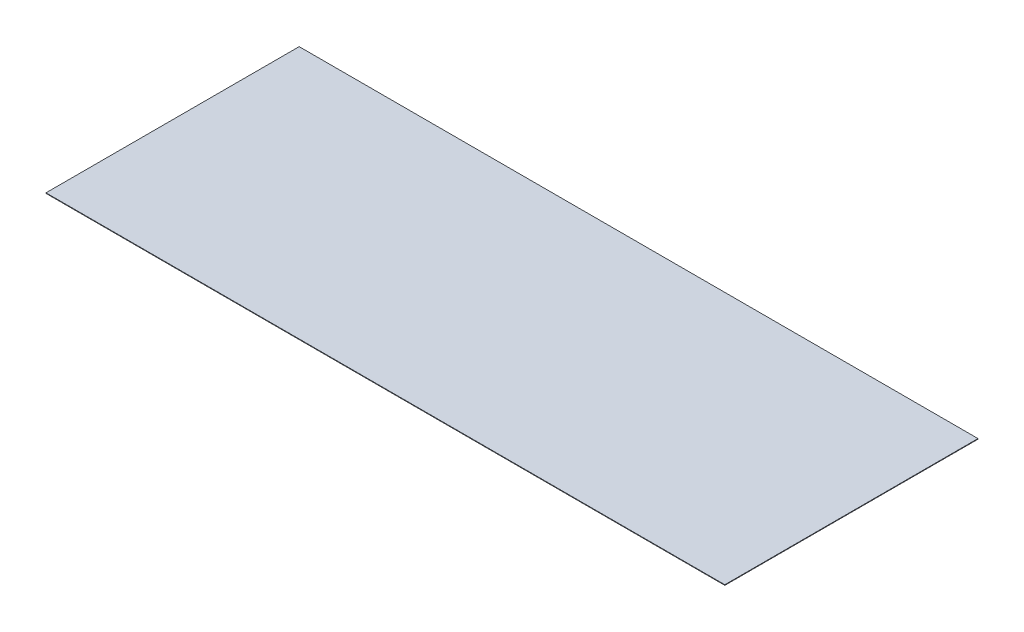
ISO-10303-21;
HEADER;
FILE_DESCRIPTION(('STEP AP214'),'2;1');
FILE_NAME('part.step','',(''),(''),'','','');
FILE_SCHEMA(('AUTOMOTIVE_DESIGN { 1 0 10303 214 1 1 1 1 }'));
ENDSEC;
DATA;
#1=APPLICATION_CONTEXT('core data for automotive mechanical design processes');
#2=APPLICATION_PROTOCOL_DEFINITION('international standard','automotive_design',2000,#1);
#3=PRODUCT_CONTEXT('',#1,'mechanical');
#4=PRODUCT('Part','Part','',(#3));
#5=PRODUCT_RELATED_PRODUCT_CATEGORY('part','',(#4));
#6=PRODUCT_DEFINITION_FORMATION('','',#4);
#7=PRODUCT_DEFINITION_CONTEXT('part definition',#1,'design');
#8=PRODUCT_DEFINITION('design','',#6,#7);
#9=PRODUCT_DEFINITION_SHAPE('','',#8);
#10=(LENGTH_UNIT() NAMED_UNIT(*) SI_UNIT(.MILLI.,.METRE.));
#11=(NAMED_UNIT(*) PLANE_ANGLE_UNIT() SI_UNIT($,.RADIAN.));
#12=(NAMED_UNIT(*) SI_UNIT($,.STERADIAN.) SOLID_ANGLE_UNIT());
#13=UNCERTAINTY_MEASURE_WITH_UNIT(LENGTH_MEASURE(1.E-05),#10,'distance_accuracy_value','');
#14=(GEOMETRIC_REPRESENTATION_CONTEXT(3) GLOBAL_UNCERTAINTY_ASSIGNED_CONTEXT((#13)) GLOBAL_UNIT_ASSIGNED_CONTEXT((#10,
#11,#12)) REPRESENTATION_CONTEXT('',''));
#15=CARTESIAN_POINT('',(0.,0.,0.));
#16=DIRECTION('',(0.,0.,1.));
#17=DIRECTION('',(1.,0.,0.));
#18=AXIS2_PLACEMENT_3D('',#15,#16,#17);
#19=CARTESIAN_POINT('',(1220.,2.,-455.));
#20=DIRECTION('',(-1.,0.,0.));
#21=DIRECTION('',(0.,0.,1.));
#22=AXIS2_PLACEMENT_3D('',#19,#20,#21);
#23=PLANE('',#22);
#24=DIRECTION('',(0.,0.,-1.));
#25=VECTOR('',#24,1.);
#26=CARTESIAN_POINT('',(1220.,0.,-455.));
#27=LINE('',#26,#25);
#28=CARTESIAN_POINT('',(1220.,0.,455.));
#29=VERTEX_POINT('',#28);
#30=CARTESIAN_POINT('',(1220.,0.,-455.));
#31=VERTEX_POINT('',#30);
#32=EDGE_CURVE('E96',#29,#31,#27,.T.);
#33=ORIENTED_EDGE('',*,*,#32,.T.);
#34=DIRECTION('',(0.,-1.,0.));
#35=VECTOR('',#34,1.);
#36=CARTESIAN_POINT('',(1220.,2.,-455.));
#37=LINE('',#36,#35);
#38=CARTESIAN_POINT('',(1220.,2.,-455.));
#39=VERTEX_POINT('',#38);
#40=EDGE_CURVE('E11',#39,#31,#37,.T.);
#41=ORIENTED_EDGE('',*,*,#40,.F.);
#42=DIRECTION('',(0.,0.,-1.));
#43=VECTOR('',#42,1.);
#44=CARTESIAN_POINT('',(1220.,2.,-455.));
#45=LINE('',#44,#43);
#46=CARTESIAN_POINT('',(1220.,2.,455.));
#47=VERTEX_POINT('',#46);
#48=EDGE_CURVE('E84',#47,#39,#45,.T.);
#49=ORIENTED_EDGE('',*,*,#48,.F.);
#50=DIRECTION('',(0.,-1.,0.));
#51=VECTOR('',#50,1.);
#52=CARTESIAN_POINT('',(1220.,2.,455.));
#53=LINE('',#52,#51);
#54=EDGE_CURVE('E92',#47,#29,#53,.T.);
#55=ORIENTED_EDGE('',*,*,#54,.T.);
#56=EDGE_LOOP('',(#33,#41,#49,#55));
#57=FACE_BOUND('',#56,.T.);
#58=ADVANCED_FACE('F33',(#57),#23,.F.);
#59=CARTESIAN_POINT('',(-1220.,2.,-455.));
#60=DIRECTION('',(0.,0.,1.));
#61=DIRECTION('',(1.,0.,0.));
#62=AXIS2_PLACEMENT_3D('',#59,#60,#61);
#63=PLANE('',#62);
#64=DIRECTION('',(-1.,0.,0.));
#65=VECTOR('',#64,1.);
#66=CARTESIAN_POINT('',(-1220.,0.,-455.));
#67=LINE('',#66,#65);
#68=CARTESIAN_POINT('',(-1220.,0.,-455.));
#69=VERTEX_POINT('',#68);
#70=EDGE_CURVE('E88',#31,#69,#67,.T.);
#71=ORIENTED_EDGE('',*,*,#70,.T.);
#72=DIRECTION('',(0.,-1.,0.));
#73=VECTOR('',#72,1.);
#74=CARTESIAN_POINT('',(-1220.,2.,-455.));
#75=LINE('',#74,#73);
#76=CARTESIAN_POINT('',(-1220.,2.,-455.));
#77=VERTEX_POINT('',#76);
#78=EDGE_CURVE('E41',#77,#69,#75,.T.);
#79=ORIENTED_EDGE('',*,*,#78,.F.);
#80=DIRECTION('',(-1.,0.,0.));
#81=VECTOR('',#80,1.);
#82=CARTESIAN_POINT('',(-1220.,2.,-455.));
#83=LINE('',#82,#81);
#84=EDGE_CURVE('E79',#39,#77,#83,.T.);
#85=ORIENTED_EDGE('',*,*,#84,.F.);
#86=ORIENTED_EDGE('',*,*,#40,.T.);
#87=EDGE_LOOP('',(#71,#79,#85,#86));
#88=FACE_BOUND('',#87,.T.);
#89=ADVANCED_FACE('F87',(#88),#63,.F.);
#90=CARTESIAN_POINT('',(-1220.,2.,-455.));
#91=DIRECTION('',(1.,0.,0.));
#92=DIRECTION('',(0.,0.,-1.));
#93=AXIS2_PLACEMENT_3D('',#90,#91,#92);
#94=PLANE('',#93);
#95=DIRECTION('',(0.,0.,1.));
#96=VECTOR('',#95,1.);
#97=CARTESIAN_POINT('',(-1220.,0.,-455.));
#98=LINE('',#97,#96);
#99=CARTESIAN_POINT('',(-1220.,0.,455.));
#100=VERTEX_POINT('',#99);
#101=EDGE_CURVE('E66',#69,#100,#98,.T.);
#102=ORIENTED_EDGE('',*,*,#101,.T.);
#103=DIRECTION('',(0.,-1.,0.));
#104=VECTOR('',#103,1.);
#105=CARTESIAN_POINT('',(-1220.,2.,455.));
#106=LINE('',#105,#104);
#107=CARTESIAN_POINT('',(-1220.,2.,455.));
#108=VERTEX_POINT('',#107);
#109=EDGE_CURVE('E89',#108,#100,#106,.T.);
#110=ORIENTED_EDGE('',*,*,#109,.F.);
#111=DIRECTION('',(0.,0.,1.));
#112=VECTOR('',#111,1.);
#113=CARTESIAN_POINT('',(-1220.,2.,-455.));
#114=LINE('',#113,#112);
#115=EDGE_CURVE('E82',#77,#108,#114,.T.);
#116=ORIENTED_EDGE('',*,*,#115,.F.);
#117=ORIENTED_EDGE('',*,*,#78,.T.);
#118=EDGE_LOOP('',(#102,#110,#116,#117));
#119=FACE_BOUND('',#118,.T.);
#120=ADVANCED_FACE('F90',(#119),#94,.F.);
#121=CARTESIAN_POINT('',(-1220.,2.,455.));
#122=DIRECTION('',(0.,0.,-1.));
#123=DIRECTION('',(-1.,0.,0.));
#124=AXIS2_PLACEMENT_3D('',#121,#122,#123);
#125=PLANE('',#124);
#126=DIRECTION('',(1.,0.,0.));
#127=VECTOR('',#126,1.);
#128=CARTESIAN_POINT('',(-1220.,0.,455.));
#129=LINE('',#128,#127);
#130=EDGE_CURVE('E72',#100,#29,#129,.T.);
#131=ORIENTED_EDGE('',*,*,#130,.T.);
#132=ORIENTED_EDGE('',*,*,#54,.F.);
#133=DIRECTION('',(1.,0.,0.));
#134=VECTOR('',#133,1.);
#135=CARTESIAN_POINT('',(-1220.,2.,455.));
#136=LINE('',#135,#134);
#137=EDGE_CURVE('E49',#108,#47,#136,.T.);
#138=ORIENTED_EDGE('',*,*,#137,.F.);
#139=ORIENTED_EDGE('',*,*,#109,.T.);
#140=EDGE_LOOP('',(#131,#132,#138,#139));
#141=FACE_BOUND('',#140,.T.);
#142=ADVANCED_FACE('F103',(#141),#125,.F.);
#143=CARTESIAN_POINT('',(0.,2.,0.));
#144=DIRECTION('',(0.,1.,0.));
#145=DIRECTION('',(0.,0.,1.));
#146=AXIS2_PLACEMENT_3D('',#143,#144,#145);
#147=PLANE('',#146);
#148=ORIENTED_EDGE('',*,*,#48,.T.);
#149=ORIENTED_EDGE('',*,*,#84,.T.);
#150=ORIENTED_EDGE('',*,*,#115,.T.);
#151=ORIENTED_EDGE('',*,*,#137,.T.);
#152=EDGE_LOOP('',(#148,#149,#150,#151));
#153=FACE_BOUND('',#152,.T.);
#154=ADVANCED_FACE('F80',(#153),#147,.T.);
#155=CARTESIAN_POINT('',(0.,0.,0.));
#156=DIRECTION('',(0.,1.,0.));
#157=DIRECTION('',(0.,0.,1.));
#158=AXIS2_PLACEMENT_3D('',#155,#156,#157);
#159=PLANE('',#158);
#160=ORIENTED_EDGE('',*,*,#32,.F.);
#161=ORIENTED_EDGE('',*,*,#130,.F.);
#162=ORIENTED_EDGE('',*,*,#101,.F.);
#163=ORIENTED_EDGE('',*,*,#70,.F.);
#164=EDGE_LOOP('',(#160,#161,#162,#163));
#165=FACE_BOUND('',#164,.T.);
#166=ADVANCED_FACE('F106',(#165),#159,.F.);
#167=CLOSED_SHELL('',(#58,#89,#120,#142,#154,#166));
#168=MANIFOLD_SOLID_BREP('B2',#167);
#169=ADVANCED_BREP_SHAPE_REPRESENTATION('',(#18,#168),#14);
#170=SHAPE_DEFINITION_REPRESENTATION(#9,#169);
ENDSEC;
END-ISO-10303-21;
